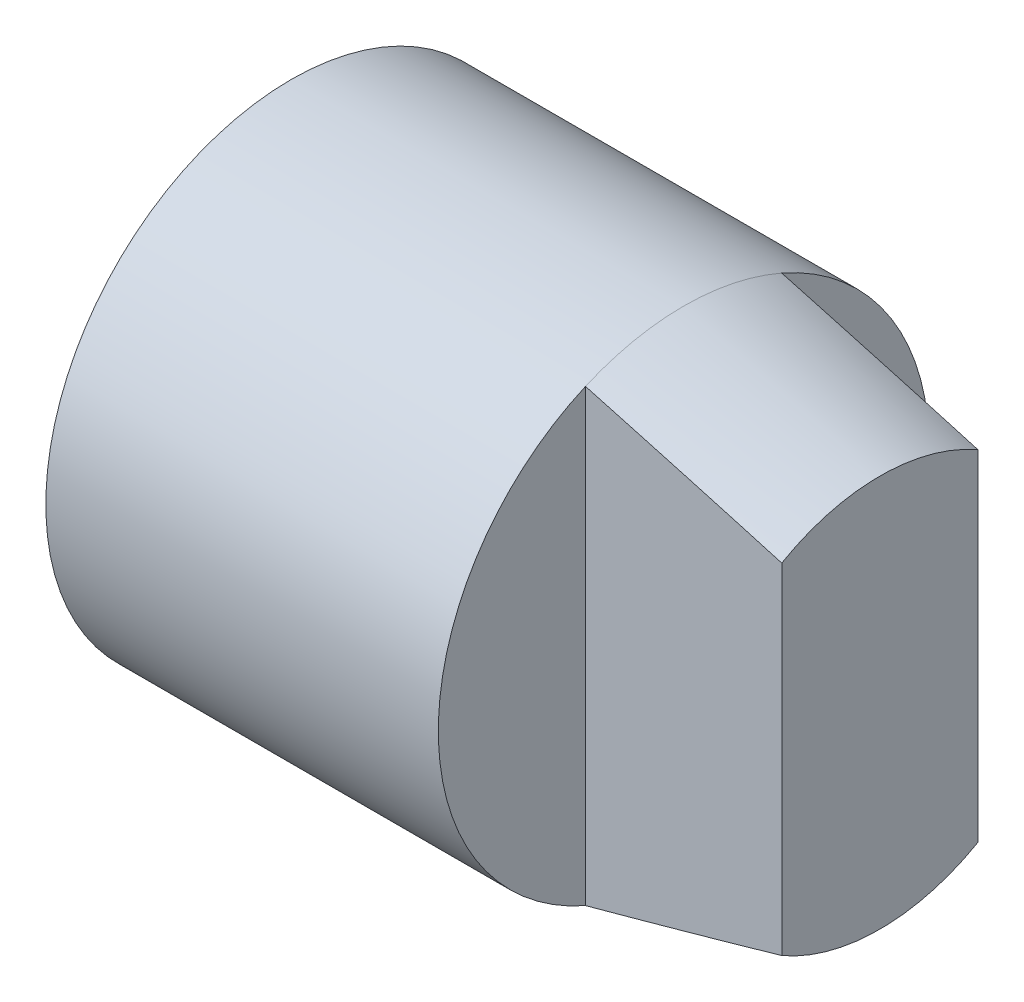
ISO-10303-21;
HEADER;
FILE_DESCRIPTION(('STEP AP214'),'2;1');
FILE_NAME('part.step','',(''),(''),'','','');
FILE_SCHEMA(('AUTOMOTIVE_DESIGN { 1 0 10303 214 1 1 1 1 }'));
ENDSEC;
DATA;
#1=APPLICATION_CONTEXT('core data for automotive mechanical design processes');
#2=APPLICATION_PROTOCOL_DEFINITION('international standard','automotive_design',2000,#1);
#3=PRODUCT_CONTEXT('',#1,'mechanical');
#4=PRODUCT('Part','Part','',(#3));
#5=PRODUCT_RELATED_PRODUCT_CATEGORY('part','',(#4));
#6=PRODUCT_DEFINITION_FORMATION('','',#4);
#7=PRODUCT_DEFINITION_CONTEXT('part definition',#1,'design');
#8=PRODUCT_DEFINITION('design','',#6,#7);
#9=PRODUCT_DEFINITION_SHAPE('','',#8);
#10=(LENGTH_UNIT() NAMED_UNIT(*) SI_UNIT(.MILLI.,.METRE.));
#11=(NAMED_UNIT(*) PLANE_ANGLE_UNIT() SI_UNIT($,.RADIAN.));
#12=(NAMED_UNIT(*) SI_UNIT($,.STERADIAN.) SOLID_ANGLE_UNIT());
#13=UNCERTAINTY_MEASURE_WITH_UNIT(LENGTH_MEASURE(1.E-05),#10,'distance_accuracy_value','');
#14=(GEOMETRIC_REPRESENTATION_CONTEXT(3) GLOBAL_UNCERTAINTY_ASSIGNED_CONTEXT((#13)) GLOBAL_UNIT_ASSIGNED_CONTEXT((#10,
#11,#12)) REPRESENTATION_CONTEXT('',''));
#15=CARTESIAN_POINT('',(0.,0.,0.));
#16=DIRECTION('',(0.,0.,1.));
#17=DIRECTION('',(1.,0.,0.));
#18=AXIS2_PLACEMENT_3D('',#15,#16,#17);
#19=CARTESIAN_POINT('',(12.,0.,0.));
#20=DIRECTION('',(-1.,0.,0.));
#21=DIRECTION('',(0.,-1.,0.));
#22=AXIS2_PLACEMENT_3D('',#19,#20,#21);
#23=CONICAL_SURFACE('',#22,4.,0.244978663126864);
#24=CARTESIAN_POINT('',(8.,0.,0.));
#25=DIRECTION('',(1.,0.,0.));
#26=DIRECTION('',(0.,1.,0.));
#27=AXIS2_PLACEMENT_3D('',#24,#25,#26);
#28=CIRCLE('',#27,5.);
#29=CARTESIAN_POINT('',(8.,4.58257569495584,-2.));
#30=VERTEX_POINT('',#29);
#31=CARTESIAN_POINT('',(8.,4.58257569495584,2.));
#32=VERTEX_POINT('',#31);
#33=EDGE_CURVE('E90',#30,#32,#28,.T.);
#34=ORIENTED_EDGE('',*,*,#33,.T.);
#35=CARTESIAN_POINT('',(-2.0002,7.22846802597203,2.));
#36=CARTESIAN_POINT('',(-1.51451614912184,7.10248264126689,2.));
#37=CARTESIAN_POINT('',(-1.02888789272762,6.97628273818266,2.));
#38=CARTESIAN_POINT('',(-0.0577654877696035,6.7233659666911,2.));
#39=CARTESIAN_POINT('',(0.427728660652426,6.59664909773948,2.));
#40=CARTESIAN_POINT('',(1.88402400109723,6.21557847186663,2.));
#41=CARTESIAN_POINT('',(2.8545880859746,5.9603176470961,2.));
#42=CARTESIAN_POINT('',(4.79962564526204,5.44504037298755,2.));
#43=CARTESIAN_POINT('',(5.77409453891958,5.18500657923882,2.));
#44=CARTESIAN_POINT('',(7.23467688673694,4.79085837192006,2.));
#45=CARTESIAN_POINT('',(7.72134343537152,4.65879475880361,2.));
#46=CARTESIAN_POINT('',(8.69419197512953,4.39289650874845,2.));
#47=CARTESIAN_POINT('',(9.18037396724444,4.25906187544159,2.));
#48=CARTESIAN_POINT('',(10.1516123384769,3.98920774658214,2.));
#49=CARTESIAN_POINT('',(10.6366693559981,3.85319055362538,2.));
#50=CARTESIAN_POINT('',(11.6059174910226,3.57800611625322,2.));
#51=CARTESIAN_POINT('',(12.090108562533,3.43883870958539,2.));
#52=CARTESIAN_POINT('',(13.0559354156415,3.15645600699188,2.));
#53=CARTESIAN_POINT('',(13.5375745685519,3.01325232016458,2.));
#54=CARTESIAN_POINT('',(14.2584900294185,2.79348355472626,2.));
#55=CARTESIAN_POINT('',(14.498523488156,2.7194047281816,2.));
#56=CARTESIAN_POINT('',(14.9779273626317,2.56913630114278,2.));
#57=CARTESIAN_POINT('',(15.2172977859749,2.49294672497022,2.));
#58=CARTESIAN_POINT('',(15.69497590454,2.33790472224026,2.));
#59=CARTESIAN_POINT('',(15.9332842732131,2.25905437954589,2.));
#60=CARTESIAN_POINT('',(16.4087364601807,2.09769313864658,2.));
#61=CARTESIAN_POINT('',(16.6458799341565,2.01518122289039,2.));
#62=CARTESIAN_POINT('',(17.1198070450854,1.84458468366549,2.));
#63=CARTESIAN_POINT('',(17.3565797393533,1.75646924445832,2.));
#64=CARTESIAN_POINT('',(17.709413862234,1.61856076217043,2.));
#65=CARTESIAN_POINT('',(17.826600020583,1.57165156624763,2.));
#66=CARTESIAN_POINT('',(18.0599560769098,1.47538209072933,2.));
#67=CARTESIAN_POINT('',(18.1761260463733,1.42602198520572,2.));
#68=CARTESIAN_POINT('',(18.4080302061413,1.32369381576228,2.));
#69=CARTESIAN_POINT('',(18.5237528156264,1.2706992523713,2.));
#70=CARTESIAN_POINT('',(18.7532628449076,1.16022319028801,2.));
#71=CARTESIAN_POINT('',(18.867047077319,1.10273503452572,2.));
#72=CARTESIAN_POINT('',(19.0902407361248,0.98202295170429,2.));
#73=CARTESIAN_POINT('',(19.1996815057438,0.918858862198975,2.));
#74=CARTESIAN_POINT('',(19.3591438444748,0.816993400881168,2.));
#75=CARTESIAN_POINT('',(19.4114559542433,0.781897208136039,2.));
#76=CARTESIAN_POINT('',(19.5138426908781,0.708602417337149,2.));
#77=CARTESIAN_POINT('',(19.5639189263303,0.670406107266665,2.));
#78=CARTESIAN_POINT('',(19.6490327928431,0.599593581681322,2.));
#79=CARTESIAN_POINT('',(19.6847883949287,0.567848016220881,2.));
#80=CARTESIAN_POINT('',(19.7535478955615,0.50128437266625,2.));
#81=CARTESIAN_POINT('',(19.7865446454993,0.466458766100048,2.));
#82=CARTESIAN_POINT('',(19.848611780038,0.392614535045337,2.));
#83=CARTESIAN_POINT('',(19.8776259342283,0.353547554390875,2.));
#84=CARTESIAN_POINT('',(19.9285157854014,0.271004725648065,2.));
#85=CARTESIAN_POINT('',(19.9504234946038,0.227549838823551,2.));
#86=CARTESIAN_POINT('',(19.9769945014551,0.154290400450305,2.));
#87=CARTESIAN_POINT('',(19.9850505546592,0.125731230762945,2.));
#88=CARTESIAN_POINT('',(19.9962581178203,0.0676712057267845,2.));
#89=CARTESIAN_POINT('',(19.9994162238442,0.038171671536174,2.));
#90=CARTESIAN_POINT('',(20.0004362553874,-0.0209947447958754,2.));
#91=CARTESIAN_POINT('',(19.9982851339489,-0.0506618600907232,2.));
#92=CARTESIAN_POINT('',(19.9889424522072,-0.109197554916006,2.));
#93=CARTESIAN_POINT('',(19.9817446796271,-0.138065104630483,2.));
#94=CARTESIAN_POINT('',(19.9599584664642,-0.203835422116844,2.));
#95=CARTESIAN_POINT('',(19.9436987065355,-0.240176075274194,2.));
#96=CARTESIAN_POINT('',(19.9057348513049,-0.309869196578081,2.));
#97=CARTESIAN_POINT('',(19.8840172254406,-0.343213954514625,2.));
#98=CARTESIAN_POINT('',(19.8162013443428,-0.435225125757254,2.));
#99=CARTESIAN_POINT('',(19.7654419018954,-0.490411197592114,2.));
#100=CARTESIAN_POINT('',(19.6844083260909,-0.567823957165754,2.));
#101=CARTESIAN_POINT('',(19.656517416038,-0.592780713297843,2.));
#102=CARTESIAN_POINT('',(19.599452346796,-0.64118010171495,2.));
#103=CARTESIAN_POINT('',(19.5702788229959,-0.664623469815274,2.));
#104=CARTESIAN_POINT('',(19.4842344448066,-0.730808162523537,2.));
#105=CARTESIAN_POINT('',(19.4261021857045,-0.771895638567213,2.));
#106=CARTESIAN_POINT('',(19.3075853485509,-0.850709250397505,2.));
#107=CARTESIAN_POINT('',(19.2471992874885,-0.888433115558798,2.));
#108=CARTESIAN_POINT('',(19.1247544272456,-0.961364439216947,2.));
#109=CARTESIAN_POINT('',(19.0626922082253,-0.996566117789744,2.));
#110=CARTESIAN_POINT('',(18.9374414752885,-1.06491374292275,2.));
#111=CARTESIAN_POINT('',(18.8742527820821,-1.09805935841024,2.));
#112=CARTESIAN_POINT('',(18.6827685021586,-1.19536562599966,2.));
#113=CARTESIAN_POINT('',(18.5532031289877,-1.25702273264782,2.));
#114=CARTESIAN_POINT('',(18.2922246657759,-1.37567594918311,2.));
#115=CARTESIAN_POINT('',(18.1608146116946,-1.43267885747498,2.));
#116=CARTESIAN_POINT('',(17.8984177980946,-1.54257552352026,2.));
#117=CARTESIAN_POINT('',(17.7674501350342,-1.59551506229089,2.));
#118=CARTESIAN_POINT('',(17.5045328463303,-1.69889962025066,2.));
#119=CARTESIAN_POINT('',(17.3725831752649,-1.7493445232174,2.));
#120=CARTESIAN_POINT('',(16.9755863772304,-1.8977785766119,2.));
#121=CARTESIAN_POINT('',(16.7094479013845,-1.99284405561265,2.));
#122=CARTESIAN_POINT('',(16.175060404323,-2.17793191024643,2.));
#123=CARTESIAN_POINT('',(15.9068090990323,-2.26794760590144,2.));
#124=CARTESIAN_POINT('',(15.3691289212157,-2.44426552146077,2.));
#125=CARTESIAN_POINT('',(15.0997001983596,-2.5305681990477,2.));
#126=CARTESIAN_POINT('',(14.5611377565972,-2.70005950505311,2.));
#127=CARTESIAN_POINT('',(14.2920077249703,-2.78325989765225,2.));
#128=CARTESIAN_POINT('',(13.7530986405364,-2.94755635182702,2.));
#129=CARTESIAN_POINT('',(13.4833195683891,-3.02865234982492,2.));
#130=CARTESIAN_POINT('',(12.6736013871912,-3.26936492003093,2.));
#131=CARTESIAN_POINT('',(12.1329298511598,-3.42651523247903,2.));
#132=CARTESIAN_POINT('',(11.0286577087625,-3.74269588704149,2.));
#133=CARTESIAN_POINT('',(10.4650066930338,-3.90154910745565,2.));
#134=CARTESIAN_POINT('',(9.33678907598791,-4.21598588527425,2.));
#135=CARTESIAN_POINT('',(8.77222246589674,-4.37156941114435,2.));
#136=CARTESIAN_POINT('',(7.6422771858248,-4.6804049512851,2.));
#137=CARTESIAN_POINT('',(7.07689832780694,-4.83365627623403,2.));
#138=CARTESIAN_POINT('',(5.94565833657781,-5.13836908123086,2.));
#139=CARTESIAN_POINT('',(5.3797972028527,-5.28983055936922,2.));
#140=CARTESIAN_POINT('',(4.24637824130514,-5.59172379868846,2.));
#141=CARTESIAN_POINT('',(3.67881954829321,-5.74215230888988,2.));
#142=CARTESIAN_POINT('',(2.54341143597986,-6.04191078547309,2.));
#143=CARTESIAN_POINT('',(1.97556201626708,-6.19124075029589,2.));
#144=CARTESIAN_POINT('',(0.839833651524471,-6.48896562105166,2.));
#145=CARTESIAN_POINT('',(0.271954788528565,-6.63736084009058,2.));
#146=CARTESIAN_POINT('',(-0.863991260038643,-6.93342255666017,2.));
#147=CARTESIAN_POINT('',(-1.43205844509685,-7.08108905615912,2.));
#148=CARTESIAN_POINT('',(-2.0002,-7.22846802597203,2.));
#149=B_SPLINE_CURVE_WITH_KNOTS('',3,(#35,#36,#37,#38,#39,#40,#41,#42,#43,#44,#45,#46,#47,#48,
#49,#50,#51,#52,#53,#54,#55,#56,#57,#58,#59,#60,#61,#62,#63,#64,#65,#66,#67,#68,#69,#70,#71,#72,
#73,#74,#75,#76,#77,#78,#79,#80,#81,#82,#83,#84,#85,#86,#87,#88,#89,#90,#91,#92,#93,#94,#95,#96,
#97,#98,#99,#100,#101,#102,#103,#104,#105,#106,#107,#108,#109,#110,#111,#112,#113,#114,#115,
#116,#117,#118,#119,#120,#121,#122,#123,#124,#125,#126,#127,#128,#129,#130,#131,#132,#133,#134,
#135,#136,#137,#138,#139,#140,#141,#142,#143,#144,#145,#146,#147,#148),.UNSPECIFIED.,.F.,.F.,(4,
2,2,2,2,2,2,2,2,2,2,2,2,2,2,2,2,2,2,2,2,2,2,2,2,2,2,2,2,2,2,2,2,2,2,2,2,2,2,2,2,2,2,2,2,2,2,2,2,
2,2,2,2,2,2,2,4),(0.,1.50527408693145,3.01054975906293,6.02125605997112,9.0469447606816,
10.5597430414629,12.0725382204026,13.5838305393313,15.095200875609,16.6025961363395,
17.3562025347226,18.1098002531127,18.8628208742709,19.6160520866632,20.3738602817876,
20.7525181924256,21.1311492478594,21.5129166745275,21.8952608021117,22.2739637353108,
22.4628706722257,22.6516394360499,22.7949594943984,22.9386400962085,23.0841768632414,
23.2290486240611,23.3177113004494,23.4062544707831,23.4950154446843,23.5838858729603,
23.7026395626015,23.8216906091684,24.045296463105,24.1575736556658,24.2697958409389,
24.4831788917196,24.6967049143397,24.9107055679924,25.1247405916222,25.5550515342491,
25.9847222357714,26.4084752716324,26.8322480311285,27.6799763121851,28.528800755637,
29.3775202677928,30.2226011927276,31.0677076194944,32.7568164858643,34.5136289366644,
36.2704583231541,38.0277972618344,39.7851380752135,41.5466032887205,43.3080710015209,
45.0689134371587,46.8297511141094),.UNSPECIFIED.);
#150=CARTESIAN_POINT('',(12.,3.46410161513776,2.));
#151=VERTEX_POINT('',#150);
#152=EDGE_CURVE('E72',#32,#151,#149,.T.);
#153=ORIENTED_EDGE('',*,*,#152,.T.);
#154=CARTESIAN_POINT('',(12.,0.,0.));
#155=DIRECTION('',(1.,0.,0.));
#156=DIRECTION('',(0.,1.,0.));
#157=AXIS2_PLACEMENT_3D('',#154,#155,#156);
#158=CIRCLE('',#157,4.);
#159=CARTESIAN_POINT('',(12.,3.46410161513776,-2.));
#160=VERTEX_POINT('',#159);
#161=EDGE_CURVE('E81',#160,#151,#158,.T.);
#162=ORIENTED_EDGE('',*,*,#161,.F.);
#163=CARTESIAN_POINT('',(-2.0002,-7.22846802597203,-2.));
#164=CARTESIAN_POINT('',(-1.51451614912185,-7.10248264126689,-2.));
#165=CARTESIAN_POINT('',(-1.02888789272763,-6.97628273818266,-2.));
#166=CARTESIAN_POINT('',(-0.0577654877696096,-6.7233659666911,-2.));
#167=CARTESIAN_POINT('',(0.427728660652419,-6.59664909773949,-2.));
#168=CARTESIAN_POINT('',(1.88402400109723,-6.21557847186663,-2.));
#169=CARTESIAN_POINT('',(2.85458808597459,-5.9603176470961,-2.));
#170=CARTESIAN_POINT('',(4.79962564526204,-5.44504037298755,-2.));
#171=CARTESIAN_POINT('',(5.77409453891958,-5.18500657923882,-2.));
#172=CARTESIAN_POINT('',(7.23467688673693,-4.79085837192006,-2.));
#173=CARTESIAN_POINT('',(7.72134343537152,-4.65879475880361,-2.));
#174=CARTESIAN_POINT('',(8.69419197512952,-4.39289650874845,-2.));
#175=CARTESIAN_POINT('',(9.18037396724443,-4.25906187544159,-2.));
#176=CARTESIAN_POINT('',(10.1516123384769,-3.98920774658214,-2.));
#177=CARTESIAN_POINT('',(10.6366693559981,-3.85319055362538,-2.));
#178=CARTESIAN_POINT('',(11.6059174910226,-3.57800611625322,-2.));
#179=CARTESIAN_POINT('',(12.090108562533,-3.43883870958539,-2.));
#180=CARTESIAN_POINT('',(13.0559354156415,-3.15645600699188,-2.));
#181=CARTESIAN_POINT('',(13.5375745685519,-3.01325232016457,-2.));
#182=CARTESIAN_POINT('',(14.2584900294185,-2.79348355472626,-2.));
#183=CARTESIAN_POINT('',(14.498523488156,-2.7194047281816,-2.));
#184=CARTESIAN_POINT('',(14.9779273626317,-2.56913630114278,-2.));
#185=CARTESIAN_POINT('',(15.2172977859749,-2.49294672497021,-2.));
#186=CARTESIAN_POINT('',(15.69497590454,-2.33790472224025,-2.));
#187=CARTESIAN_POINT('',(15.9332842732131,-2.25905437954589,-2.));
#188=CARTESIAN_POINT('',(16.4087364601807,-2.09769313864658,-2.));
#189=CARTESIAN_POINT('',(16.6458799341565,-2.01518122289039,-2.));
#190=CARTESIAN_POINT('',(17.1198070450854,-1.84458468366549,-2.));
#191=CARTESIAN_POINT('',(17.3565797393533,-1.75646924445831,-2.));
#192=CARTESIAN_POINT('',(17.709413862234,-1.61856076217043,-2.));
#193=CARTESIAN_POINT('',(17.826600020583,-1.57165156624763,-2.));
#194=CARTESIAN_POINT('',(18.0599560769097,-1.47538209072933,-2.));
#195=CARTESIAN_POINT('',(18.1761260463733,-1.42602198520572,-2.));
#196=CARTESIAN_POINT('',(18.4080302061413,-1.32369381576228,-2.));
#197=CARTESIAN_POINT('',(18.5237528156264,-1.2706992523713,-2.));
#198=CARTESIAN_POINT('',(18.7532628449075,-1.16022319028801,-2.));
#199=CARTESIAN_POINT('',(18.867047077319,-1.10273503452572,-2.));
#200=CARTESIAN_POINT('',(19.0902407361248,-0.982022951704292,-2.));
#201=CARTESIAN_POINT('',(19.1996815057438,-0.918858862198975,-2.));
#202=CARTESIAN_POINT('',(19.3591438444748,-0.81699340088117,-2.));
#203=CARTESIAN_POINT('',(19.4114559542432,-0.781897208136042,-2.));
#204=CARTESIAN_POINT('',(19.5138426908781,-0.708602417337151,-2.));
#205=CARTESIAN_POINT('',(19.5639189263303,-0.670406107266666,-2.));
#206=CARTESIAN_POINT('',(19.6490327928431,-0.599593581681322,-2.));
#207=CARTESIAN_POINT('',(19.6847883949287,-0.567848016220881,-2.));
#208=CARTESIAN_POINT('',(19.7535478955615,-0.501284372666248,-2.));
#209=CARTESIAN_POINT('',(19.7865446454993,-0.466458766100047,-2.));
#210=CARTESIAN_POINT('',(19.848611780038,-0.392614535045335,-2.));
#211=CARTESIAN_POINT('',(19.8776259342283,-0.353547554390873,-2.));
#212=CARTESIAN_POINT('',(19.9285157854014,-0.271004725648063,-2.));
#213=CARTESIAN_POINT('',(19.9504234946038,-0.227549838823549,-2.));
#214=CARTESIAN_POINT('',(19.976994501455,-0.154290400450303,-2.));
#215=CARTESIAN_POINT('',(19.9850505546592,-0.125731230762943,-2.));
#216=CARTESIAN_POINT('',(19.9962581178203,-0.0676712057267824,-2.));
#217=CARTESIAN_POINT('',(19.9994162238442,-0.0381716715361727,-2.));
#218=CARTESIAN_POINT('',(20.0004362553874,0.0209947447958757,-2.));
#219=CARTESIAN_POINT('',(19.9982851339489,0.0506618600907232,-2.));
#220=CARTESIAN_POINT('',(19.9889424522072,0.109197554916007,-2.));
#221=CARTESIAN_POINT('',(19.9817446796271,0.138065104630483,-2.));
#222=CARTESIAN_POINT('',(19.9599584664642,0.203835422116846,-2.));
#223=CARTESIAN_POINT('',(19.9436987065355,0.240176075274195,-2.));
#224=CARTESIAN_POINT('',(19.9057348513049,0.309869196578082,-2.));
#225=CARTESIAN_POINT('',(19.8840172254406,0.343213954514627,-2.));
#226=CARTESIAN_POINT('',(19.8162013443428,0.435225125757256,-2.));
#227=CARTESIAN_POINT('',(19.7654419018953,0.490411197592113,-2.));
#228=CARTESIAN_POINT('',(19.6844083260909,0.567823957165755,-2.));
#229=CARTESIAN_POINT('',(19.656517416038,0.592780713297845,-2.));
#230=CARTESIAN_POINT('',(19.599452346796,0.641180101714954,-2.));
#231=CARTESIAN_POINT('',(19.5702788229959,0.664623469815278,-2.));
#232=CARTESIAN_POINT('',(19.4842344448066,0.73080816252354,-2.));
#233=CARTESIAN_POINT('',(19.4261021857044,0.771895638567216,-2.));
#234=CARTESIAN_POINT('',(19.3075853485509,0.850709250397508,-2.));
#235=CARTESIAN_POINT('',(19.2471992874885,0.888433115558802,-2.));
#236=CARTESIAN_POINT('',(19.1247544272456,0.961364439216952,-2.));
#237=CARTESIAN_POINT('',(19.0626922082253,0.996566117789749,-2.));
#238=CARTESIAN_POINT('',(18.9374414752885,1.06491374292275,-2.));
#239=CARTESIAN_POINT('',(18.8742527820821,1.09805935841024,-2.));
#240=CARTESIAN_POINT('',(18.6827685021585,1.19536562599967,-2.));
#241=CARTESIAN_POINT('',(18.5532031289876,1.25702273264782,-2.));
#242=CARTESIAN_POINT('',(18.2922246657759,1.37567594918312,-2.));
#243=CARTESIAN_POINT('',(18.1608146116945,1.43267885747499,-2.));
#244=CARTESIAN_POINT('',(17.8984177980945,1.54257552352027,-2.));
#245=CARTESIAN_POINT('',(17.7674501350342,1.5955150622909,-2.));
#246=CARTESIAN_POINT('',(17.5045328463303,1.69889962025066,-2.));
#247=CARTESIAN_POINT('',(17.3725831752649,1.74934452321741,-2.));
#248=CARTESIAN_POINT('',(16.9755863772303,1.89777857661191,-2.));
#249=CARTESIAN_POINT('',(16.7094479013844,1.99284405561266,-2.));
#250=CARTESIAN_POINT('',(16.175060404323,2.17793191024644,-2.));
#251=CARTESIAN_POINT('',(15.9068090990323,2.26794760590145,-2.));
#252=CARTESIAN_POINT('',(15.3691289212157,2.44426552146079,-2.));
#253=CARTESIAN_POINT('',(15.0997001983595,2.53056819904771,-2.));
#254=CARTESIAN_POINT('',(14.5611377565971,2.70005950505312,-2.));
#255=CARTESIAN_POINT('',(14.2920077249702,2.78325989765227,-2.));
#256=CARTESIAN_POINT('',(13.7530986405363,2.94755635182704,-2.));
#257=CARTESIAN_POINT('',(13.4833195683891,3.02865234982494,-2.));
#258=CARTESIAN_POINT('',(12.6736013871912,3.26936492003095,-2.));
#259=CARTESIAN_POINT('',(12.1329298511597,3.42651523247905,-2.));
#260=CARTESIAN_POINT('',(11.0286577087624,3.74269588704151,-2.));
#261=CARTESIAN_POINT('',(10.4650066930338,3.90154910745567,-2.));
#262=CARTESIAN_POINT('',(9.33678907598784,4.21598588527426,-2.));
#263=CARTESIAN_POINT('',(8.77222246589668,4.37156941114436,-2.));
#264=CARTESIAN_POINT('',(7.64227718582475,4.68040495128511,-2.));
#265=CARTESIAN_POINT('',(7.07689832780689,4.83365627623404,-2.));
#266=CARTESIAN_POINT('',(5.94565833657777,5.13836908123087,-2.));
#267=CARTESIAN_POINT('',(5.37979720285267,5.28983055936923,-2.));
#268=CARTESIAN_POINT('',(4.24637824130511,5.59172379868846,-2.));
#269=CARTESIAN_POINT('',(3.67881954829318,5.74215230888988,-2.));
#270=CARTESIAN_POINT('',(2.54341143597984,6.0419107854731,-2.));
#271=CARTESIAN_POINT('',(1.97556201626707,6.19124075029589,-2.));
#272=CARTESIAN_POINT('',(0.839833651524459,6.48896562105167,-2.));
#273=CARTESIAN_POINT('',(0.271954788528552,6.63736084009059,-2.));
#274=CARTESIAN_POINT('',(-0.863991260038651,6.93342255666017,-2.));
#275=CARTESIAN_POINT('',(-1.43205844509686,7.08108905615912,-2.));
#276=CARTESIAN_POINT('',(-2.0002,7.22846802597203,-2.));
#277=B_SPLINE_CURVE_WITH_KNOTS('',3,(#163,#164,#165,#166,#167,#168,#169,#170,#171,#172,#173,
#174,#175,#176,#177,#178,#179,#180,#181,#182,#183,#184,#185,#186,#187,#188,#189,#190,#191,#192,
#193,#194,#195,#196,#197,#198,#199,#200,#201,#202,#203,#204,#205,#206,#207,#208,#209,#210,#211,
#212,#213,#214,#215,#216,#217,#218,#219,#220,#221,#222,#223,#224,#225,#226,#227,#228,#229,#230,
#231,#232,#233,#234,#235,#236,#237,#238,#239,#240,#241,#242,#243,#244,#245,#246,#247,#248,#249,
#250,#251,#252,#253,#254,#255,#256,#257,#258,#259,#260,#261,#262,#263,#264,#265,#266,#267,#268,
#269,#270,#271,#272,#273,#274,#275,#276),.UNSPECIFIED.,.F.,.F.,(4,2,2,2,2,2,2,2,2,2,2,2,2,2,2,2,
2,2,2,2,2,2,2,2,2,2,2,2,2,2,2,2,2,2,2,2,2,2,2,2,2,2,2,2,2,2,2,2,2,2,2,2,2,2,2,2,4),(0.,
1.50527408693145,3.01054975906293,6.02125605997112,9.0469447606816,10.5597430414629,
12.0725382204026,13.5838305393313,15.095200875609,16.6025961363395,17.3562025347226,
18.1098002531127,18.8628208742709,19.6160520866632,20.3738602817876,20.7525181924256,
21.1311492478594,21.5129166745275,21.8952608021117,22.2739637353108,22.4628706722257,
22.6516394360499,22.7949594943984,22.9386400962085,23.0841768632414,23.2290486240611,
23.3177113004494,23.4062544707831,23.4950154446843,23.5838858729603,23.7026395626015,
23.8216906091684,24.045296463105,24.1575736556658,24.2697958409389,24.4831788917196,
24.6967049143397,24.9107055679924,25.1247405916222,25.5550515342491,25.9847222357714,
26.4084752716324,26.8322480311285,27.6799763121852,28.528800755637,29.3775202677928,
30.2226011927277,31.0677076194944,32.7568164858644,34.5136289366645,36.2704583231541,
38.0277972618344,39.7851380752136,41.5466032887206,43.3080710015209,45.0689134371587,
46.8297511141094),.UNSPECIFIED.);
#278=EDGE_CURVE('E49',#160,#30,#277,.T.);
#279=ORIENTED_EDGE('',*,*,#278,.T.);
#280=EDGE_LOOP('',(#34,#153,#162,#279));
#281=FACE_BOUND('',#280,.T.);
#282=ADVANCED_FACE('F34',(#281),#23,.T.);
#283=CARTESIAN_POINT('',(12.,-3.46410161513776,2.));
#284=VERTEX_POINT('',#283);
#285=CARTESIAN_POINT('',(12.,-3.46410161513775,-2.));
#286=VERTEX_POINT('',#285);
#287=EDGE_CURVE('E94',#284,#286,#158,.T.);
#288=ORIENTED_EDGE('',*,*,#287,.F.);
#289=CARTESIAN_POINT('',(8.,-4.58257569495584,2.));
#290=VERTEX_POINT('',#289);
#291=EDGE_CURVE('E57',#284,#290,#149,.T.);
#292=ORIENTED_EDGE('',*,*,#291,.T.);
#293=CARTESIAN_POINT('',(8.,-4.58257569495584,-2.));
#294=VERTEX_POINT('',#293);
#295=EDGE_CURVE('E93',#290,#294,#28,.T.);
#296=ORIENTED_EDGE('',*,*,#295,.T.);
#297=EDGE_CURVE('E109',#294,#286,#277,.T.);
#298=ORIENTED_EDGE('',*,*,#297,.T.);
#299=EDGE_LOOP('',(#288,#292,#296,#298));
#300=FACE_BOUND('',#299,.T.);
#301=ADVANCED_FACE('F112',(#300),#23,.T.);
#302=CARTESIAN_POINT('',(12.,4.,0.));
#303=DIRECTION('',(1.,0.,0.));
#304=DIRECTION('',(0.,1.,0.));
#305=AXIS2_PLACEMENT_3D('',#302,#303,#304);
#306=PLANE('',#305);
#307=ORIENTED_EDGE('',*,*,#161,.T.);
#308=DIRECTION('',(0.,-1.,0.));
#309=VECTOR('',#308,1.);
#310=CARTESIAN_POINT('',(12.,4.,2.));
#311=LINE('',#310,#309);
#312=EDGE_CURVE('E11',#151,#284,#311,.T.);
#313=ORIENTED_EDGE('',*,*,#312,.T.);
#314=ORIENTED_EDGE('',*,*,#287,.T.);
#315=DIRECTION('',(0.,1.,0.));
#316=VECTOR('',#315,1.);
#317=CARTESIAN_POINT('',(12.,4.,-2.));
#318=LINE('',#317,#316);
#319=EDGE_CURVE('E42',#286,#160,#318,.T.);
#320=ORIENTED_EDGE('',*,*,#319,.T.);
#321=EDGE_LOOP('',(#307,#313,#314,#320));
#322=FACE_BOUND('',#321,.T.);
#323=ADVANCED_FACE('F105',(#322),#306,.T.);
#324=CARTESIAN_POINT('',(0.,0.,0.));
#325=DIRECTION('',(-1.,0.,0.));
#326=DIRECTION('',(0.,-1.,0.));
#327=AXIS2_PLACEMENT_3D('',#324,#325,#326);
#328=PLANE('',#327);
#329=CARTESIAN_POINT('',(0.,0.,0.));
#330=DIRECTION('',(1.,0.,0.));
#331=DIRECTION('',(0.,1.,0.));
#332=AXIS2_PLACEMENT_3D('',#329,#330,#331);
#333=CIRCLE('',#332,5.);
#334=CARTESIAN_POINT('',(0.,5.,0.));
#335=VERTEX_POINT('',#334);
#336=EDGE_CURVE('E99',#335,#335,#333,.T.);
#337=ORIENTED_EDGE('',*,*,#336,.F.);
#338=EDGE_LOOP('',(#337));
#339=FACE_BOUND('',#338,.T.);
#340=ADVANCED_FACE('F36',(#339),#328,.T.);
#341=CARTESIAN_POINT('',(12.,0.,0.));
#342=DIRECTION('',(1.,0.,0.));
#343=DIRECTION('',(0.,1.,0.));
#344=AXIS2_PLACEMENT_3D('',#341,#342,#343);
#345=CYLINDRICAL_SURFACE('',#344,5.);
#346=ORIENTED_EDGE('',*,*,#336,.T.);
#347=EDGE_LOOP('',(#346));
#348=FACE_BOUND('',#347,.T.);
#349=EDGE_CURVE('E86',#32,#290,#28,.T.);
#350=ORIENTED_EDGE('',*,*,#349,.F.);
#351=ORIENTED_EDGE('',*,*,#33,.F.);
#352=CARTESIAN_POINT('',(8.,0.,0.));
#353=DIRECTION('',(1.,0.,0.));
#354=DIRECTION('',(0.,0.,-1.));
#355=AXIS2_PLACEMENT_3D('',#352,#353,#354);
#356=CIRCLE('',#355,5.);
#357=EDGE_CURVE('E87',#294,#30,#356,.T.);
#358=ORIENTED_EDGE('',*,*,#357,.F.);
#359=ORIENTED_EDGE('',*,*,#295,.F.);
#360=EDGE_LOOP('',(#350,#351,#358,#359));
#361=FACE_BOUND('',#360,.T.);
#362=ADVANCED_FACE('F97',(#348,#361),#345,.T.);
#363=CARTESIAN_POINT('',(8.,0.,-2.));
#364=DIRECTION('',(0.,0.,-1.));
#365=DIRECTION('',(-1.,0.,0.));
#366=AXIS2_PLACEMENT_3D('',#363,#364,#365);
#367=PLANE('',#366);
#368=DIRECTION('',(0.,1.,0.));
#369=VECTOR('',#368,1.);
#370=CARTESIAN_POINT('',(8.,0.,-2.));
#371=LINE('',#370,#369);
#372=EDGE_CURVE('E201',#294,#30,#371,.T.);
#373=ORIENTED_EDGE('',*,*,#372,.T.);
#374=ORIENTED_EDGE('',*,*,#278,.F.);
#375=ORIENTED_EDGE('',*,*,#319,.F.);
#376=ORIENTED_EDGE('',*,*,#297,.F.);
#377=EDGE_LOOP('',(#373,#374,#375,#376));
#378=FACE_BOUND('',#377,.T.);
#379=ADVANCED_FACE('F108',(#378),#367,.T.);
#380=CARTESIAN_POINT('',(8.,0.,0.));
#381=DIRECTION('',(1.,0.,0.));
#382=DIRECTION('',(0.,0.,-1.));
#383=AXIS2_PLACEMENT_3D('',#380,#381,#382);
#384=PLANE('',#383);
#385=ORIENTED_EDGE('',*,*,#372,.F.);
#386=ORIENTED_EDGE('',*,*,#357,.T.);
#387=EDGE_LOOP('',(#385,#386));
#388=FACE_BOUND('',#387,.T.);
#389=ADVANCED_FACE('F132',(#388),#384,.T.);
#390=CARTESIAN_POINT('',(8.,0.,2.));
#391=DIRECTION('',(0.,0.,1.));
#392=DIRECTION('',(1.,0.,0.));
#393=AXIS2_PLACEMENT_3D('',#390,#391,#392);
#394=PLANE('',#393);
#395=DIRECTION('',(0.,-1.,0.));
#396=VECTOR('',#395,1.);
#397=CARTESIAN_POINT('',(8.,0.,2.));
#398=LINE('',#397,#396);
#399=EDGE_CURVE('E75',#32,#290,#398,.T.);
#400=ORIENTED_EDGE('',*,*,#399,.T.);
#401=ORIENTED_EDGE('',*,*,#291,.F.);
#402=ORIENTED_EDGE('',*,*,#312,.F.);
#403=ORIENTED_EDGE('',*,*,#152,.F.);
#404=EDGE_LOOP('',(#400,#401,#402,#403));
#405=FACE_BOUND('',#404,.T.);
#406=ADVANCED_FACE('F74',(#405),#394,.T.);
#407=CARTESIAN_POINT('',(8.,0.,0.));
#408=DIRECTION('',(1.,0.,0.));
#409=DIRECTION('',(0.,0.,-1.));
#410=AXIS2_PLACEMENT_3D('',#407,#408,#409);
#411=PLANE('',#410);
#412=ORIENTED_EDGE('',*,*,#399,.F.);
#413=ORIENTED_EDGE('',*,*,#349,.T.);
#414=EDGE_LOOP('',(#412,#413));
#415=FACE_BOUND('',#414,.T.);
#416=ADVANCED_FACE('F84',(#415),#411,.T.);
#417=CLOSED_SHELL('',(#282,#301,#323,#340,#362,#379,#389,#406,#416));
#418=MANIFOLD_SOLID_BREP('B2',#417);
#419=ADVANCED_BREP_SHAPE_REPRESENTATION('',(#18,#418),#14);
#420=SHAPE_DEFINITION_REPRESENTATION(#9,#419);
ENDSEC;
END-ISO-10303-21;
